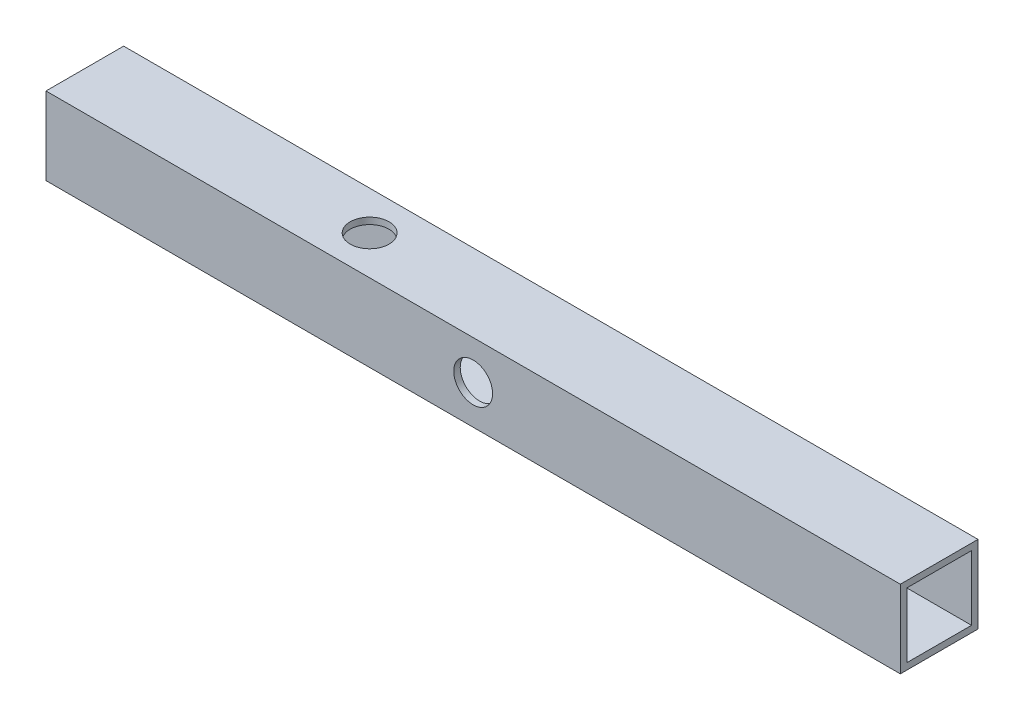
ISO-10303-21;
HEADER;
FILE_DESCRIPTION(('STEP AP214'),'2;1');
FILE_NAME('part.step','',(''),(''),'','','');
FILE_SCHEMA(('AUTOMOTIVE_DESIGN { 1 0 10303 214 1 1 1 1 }'));
ENDSEC;
DATA;
#1=APPLICATION_CONTEXT('core data for automotive mechanical design processes');
#2=APPLICATION_PROTOCOL_DEFINITION('international standard','automotive_design',2000,#1);
#3=PRODUCT_CONTEXT('',#1,'mechanical');
#4=PRODUCT('Part','Part','',(#3));
#5=PRODUCT_RELATED_PRODUCT_CATEGORY('part','',(#4));
#6=PRODUCT_DEFINITION_FORMATION('','',#4);
#7=PRODUCT_DEFINITION_CONTEXT('part definition',#1,'design');
#8=PRODUCT_DEFINITION('design','',#6,#7);
#9=PRODUCT_DEFINITION_SHAPE('','',#8);
#10=(LENGTH_UNIT() NAMED_UNIT(*) SI_UNIT(.MILLI.,.METRE.));
#11=(NAMED_UNIT(*) PLANE_ANGLE_UNIT() SI_UNIT($,.RADIAN.));
#12=(NAMED_UNIT(*) SI_UNIT($,.STERADIAN.) SOLID_ANGLE_UNIT());
#13=UNCERTAINTY_MEASURE_WITH_UNIT(LENGTH_MEASURE(1.E-05),#10,'distance_accuracy_value','');
#14=(GEOMETRIC_REPRESENTATION_CONTEXT(3) GLOBAL_UNCERTAINTY_ASSIGNED_CONTEXT((#13)) GLOBAL_UNIT_ASSIGNED_CONTEXT((#10,
#11,#12)) REPRESENTATION_CONTEXT('',''));
#15=CARTESIAN_POINT('',(0.,0.,0.));
#16=DIRECTION('',(0.,0.,1.));
#17=DIRECTION('',(1.,0.,0.));
#18=AXIS2_PLACEMENT_3D('',#15,#16,#17);
#19=CARTESIAN_POINT('',(104.775,0.,0.));
#20=DIRECTION('',(1.,0.,0.));
#21=DIRECTION('',(0.,0.,-1.));
#22=AXIS2_PLACEMENT_3D('',#19,#20,#21);
#23=PLANE('',#22);
#24=DIRECTION('',(0.,0.,-1.));
#25=VECTOR('',#24,1.);
#26=CARTESIAN_POINT('',(104.775,-9.525,-9.525));
#27=LINE('',#26,#25);
#28=CARTESIAN_POINT('',(104.775,-9.525,9.525));
#29=VERTEX_POINT('',#28);
#30=CARTESIAN_POINT('',(104.775,-9.525,-9.525));
#31=VERTEX_POINT('',#30);
#32=EDGE_CURVE('E139',#29,#31,#27,.T.);
#33=ORIENTED_EDGE('',*,*,#32,.T.);
#34=DIRECTION('',(0.,1.,0.));
#35=VECTOR('',#34,1.);
#36=CARTESIAN_POINT('',(104.775,9.525,-9.525));
#37=LINE('',#36,#35);
#38=CARTESIAN_POINT('',(104.775,9.525,-9.525));
#39=VERTEX_POINT('',#38);
#40=EDGE_CURVE('E142',#31,#39,#37,.T.);
#41=ORIENTED_EDGE('',*,*,#40,.T.);
#42=DIRECTION('',(0.,0.,1.));
#43=VECTOR('',#42,1.);
#44=CARTESIAN_POINT('',(104.775,9.525,-9.525));
#45=LINE('',#44,#43);
#46=CARTESIAN_POINT('',(104.775,9.525,9.525));
#47=VERTEX_POINT('',#46);
#48=EDGE_CURVE('E145',#39,#47,#45,.T.);
#49=ORIENTED_EDGE('',*,*,#48,.T.);
#50=DIRECTION('',(0.,-1.,0.));
#51=VECTOR('',#50,1.);
#52=CARTESIAN_POINT('',(104.775,9.525,9.525));
#53=LINE('',#52,#51);
#54=EDGE_CURVE('E147',#47,#29,#53,.T.);
#55=ORIENTED_EDGE('',*,*,#54,.T.);
#56=EDGE_LOOP('',(#33,#41,#49,#55));
#57=FACE_BOUND('',#56,.T.);
#58=DIRECTION('',(0.,1.,0.));
#59=VECTOR('',#58,1.);
#60=CARTESIAN_POINT('',(104.775,7.9375,-7.9375));
#61=LINE('',#60,#59);
#62=CARTESIAN_POINT('',(104.775,-7.9375,-7.9375));
#63=VERTEX_POINT('',#62);
#64=CARTESIAN_POINT('',(104.775,7.9375,-7.9375));
#65=VERTEX_POINT('',#64);
#66=EDGE_CURVE('E109',#63,#65,#61,.T.);
#67=ORIENTED_EDGE('',*,*,#66,.F.);
#68=DIRECTION('',(0.,0.,-1.));
#69=VECTOR('',#68,1.);
#70=CARTESIAN_POINT('',(104.775,-7.9375,-7.9375));
#71=LINE('',#70,#69);
#72=CARTESIAN_POINT('',(104.775,-7.9375,7.9375));
#73=VERTEX_POINT('',#72);
#74=EDGE_CURVE('E101',#73,#63,#71,.T.);
#75=ORIENTED_EDGE('',*,*,#74,.F.);
#76=DIRECTION('',(0.,-1.,0.));
#77=VECTOR('',#76,1.);
#78=CARTESIAN_POINT('',(104.775,7.9375,7.9375));
#79=LINE('',#78,#77);
#80=CARTESIAN_POINT('',(104.775,7.9375,7.9375));
#81=VERTEX_POINT('',#80);
#82=EDGE_CURVE('E123',#81,#73,#79,.T.);
#83=ORIENTED_EDGE('',*,*,#82,.F.);
#84=DIRECTION('',(0.,0.,1.));
#85=VECTOR('',#84,1.);
#86=CARTESIAN_POINT('',(104.775,7.9375,-7.9375));
#87=LINE('',#86,#85);
#88=EDGE_CURVE('E121',#65,#81,#87,.T.);
#89=ORIENTED_EDGE('',*,*,#88,.F.);
#90=EDGE_LOOP('',(#67,#75,#83,#89));
#91=FACE_BOUND('',#90,.T.);
#92=ADVANCED_FACE('F35',(#57,#91),#23,.T.);
#93=CARTESIAN_POINT('',(-104.775,0.,0.));
#94=DIRECTION('',(1.,0.,0.));
#95=DIRECTION('',(0.,0.,-1.));
#96=AXIS2_PLACEMENT_3D('',#93,#94,#95);
#97=PLANE('',#96);
#98=DIRECTION('',(0.,0.,-1.));
#99=VECTOR('',#98,1.);
#100=CARTESIAN_POINT('',(-104.775,-9.525,-9.525));
#101=LINE('',#100,#99);
#102=CARTESIAN_POINT('',(-104.775,-9.525,9.525));
#103=VERTEX_POINT('',#102);
#104=CARTESIAN_POINT('',(-104.775,-9.525,-9.525));
#105=VERTEX_POINT('',#104);
#106=EDGE_CURVE('E117',#103,#105,#101,.T.);
#107=ORIENTED_EDGE('',*,*,#106,.F.);
#108=DIRECTION('',(0.,-1.,0.));
#109=VECTOR('',#108,1.);
#110=CARTESIAN_POINT('',(-104.775,9.525,9.525));
#111=LINE('',#110,#109);
#112=CARTESIAN_POINT('',(-104.775,9.525,9.525));
#113=VERTEX_POINT('',#112);
#114=EDGE_CURVE('E143',#113,#103,#111,.T.);
#115=ORIENTED_EDGE('',*,*,#114,.F.);
#116=DIRECTION('',(0.,0.,1.));
#117=VECTOR('',#116,1.);
#118=CARTESIAN_POINT('',(-104.775,9.525,-9.525));
#119=LINE('',#118,#117);
#120=CARTESIAN_POINT('',(-104.775,9.525,-9.525));
#121=VERTEX_POINT('',#120);
#122=EDGE_CURVE('E154',#121,#113,#119,.T.);
#123=ORIENTED_EDGE('',*,*,#122,.F.);
#124=DIRECTION('',(0.,1.,0.));
#125=VECTOR('',#124,1.);
#126=CARTESIAN_POINT('',(-104.775,9.525,-9.525));
#127=LINE('',#126,#125);
#128=EDGE_CURVE('E152',#105,#121,#127,.T.);
#129=ORIENTED_EDGE('',*,*,#128,.F.);
#130=EDGE_LOOP('',(#107,#115,#123,#129));
#131=FACE_BOUND('',#130,.T.);
#132=DIRECTION('',(0.,0.,-1.));
#133=VECTOR('',#132,1.);
#134=CARTESIAN_POINT('',(-104.775,-7.9375,-7.9375));
#135=LINE('',#134,#133);
#136=CARTESIAN_POINT('',(-104.775,-7.9375,7.9375));
#137=VERTEX_POINT('',#136);
#138=CARTESIAN_POINT('',(-104.775,-7.9375,-7.9375));
#139=VERTEX_POINT('',#138);
#140=EDGE_CURVE('E59',#137,#139,#135,.T.);
#141=ORIENTED_EDGE('',*,*,#140,.T.);
#142=DIRECTION('',(0.,1.,0.));
#143=VECTOR('',#142,1.);
#144=CARTESIAN_POINT('',(-104.775,7.9375,-7.9375));
#145=LINE('',#144,#143);
#146=CARTESIAN_POINT('',(-104.775,7.9375,-7.9375));
#147=VERTEX_POINT('',#146);
#148=EDGE_CURVE('E116',#139,#147,#145,.T.);
#149=ORIENTED_EDGE('',*,*,#148,.T.);
#150=DIRECTION('',(0.,0.,1.));
#151=VECTOR('',#150,1.);
#152=CARTESIAN_POINT('',(-104.775,7.9375,-7.9375));
#153=LINE('',#152,#151);
#154=CARTESIAN_POINT('',(-104.775,7.9375,7.9375));
#155=VERTEX_POINT('',#154);
#156=EDGE_CURVE('E131',#147,#155,#153,.T.);
#157=ORIENTED_EDGE('',*,*,#156,.T.);
#158=DIRECTION('',(0.,-1.,0.));
#159=VECTOR('',#158,1.);
#160=CARTESIAN_POINT('',(-104.775,7.9375,7.9375));
#161=LINE('',#160,#159);
#162=EDGE_CURVE('E110',#155,#137,#161,.T.);
#163=ORIENTED_EDGE('',*,*,#162,.T.);
#164=EDGE_LOOP('',(#141,#149,#157,#163));
#165=FACE_BOUND('',#164,.T.);
#166=ADVANCED_FACE('F173',(#131,#165),#97,.F.);
#167=CARTESIAN_POINT('',(104.775,-9.525,-9.525));
#168=DIRECTION('',(0.,1.,0.));
#169=DIRECTION('',(0.,0.,1.));
#170=AXIS2_PLACEMENT_3D('',#167,#168,#169);
#171=PLANE('',#170);
#172=CARTESIAN_POINT('',(-34.925,-9.525,0.));
#173=DIRECTION('',(0.,-1.,0.));
#174=DIRECTION('',(0.,0.,-1.));
#175=AXIS2_PLACEMENT_3D('',#172,#173,#174);
#176=CIRCLE('',#175,4.7625);
#177=CARTESIAN_POINT('',(-34.925,-9.525,-4.76250000000001));
#178=VERTEX_POINT('',#177);
#179=EDGE_CURVE('E273',#178,#178,#176,.T.);
#180=ORIENTED_EDGE('',*,*,#179,.F.);
#181=EDGE_LOOP('',(#180));
#182=FACE_BOUND('',#181,.T.);
#183=ORIENTED_EDGE('',*,*,#106,.T.);
#184=DIRECTION('',(-1.,0.,0.));
#185=VECTOR('',#184,1.);
#186=CARTESIAN_POINT('',(104.775,-9.525,-9.525));
#187=LINE('',#186,#185);
#188=EDGE_CURVE('E11',#31,#105,#187,.T.);
#189=ORIENTED_EDGE('',*,*,#188,.F.);
#190=ORIENTED_EDGE('',*,*,#32,.F.);
#191=DIRECTION('',(-1.,0.,0.));
#192=VECTOR('',#191,1.);
#193=CARTESIAN_POINT('',(104.775,-9.525,9.525));
#194=LINE('',#193,#192);
#195=EDGE_CURVE('E149',#29,#103,#194,.T.);
#196=ORIENTED_EDGE('',*,*,#195,.T.);
#197=EDGE_LOOP('',(#183,#189,#190,#196));
#198=FACE_BOUND('',#197,.T.);
#199=ADVANCED_FACE('F37',(#182,#198),#171,.F.);
#200=CARTESIAN_POINT('',(104.775,9.525,-9.525));
#201=DIRECTION('',(0.,0.,1.));
#202=DIRECTION('',(1.,0.,0.));
#203=AXIS2_PLACEMENT_3D('',#200,#201,#202);
#204=PLANE('',#203);
#205=CARTESIAN_POINT('',(69.85,0.,-9.525));
#206=DIRECTION('',(0.,0.,1.));
#207=DIRECTION('',(1.,0.,0.));
#208=AXIS2_PLACEMENT_3D('',#205,#206,#207);
#209=CIRCLE('',#208,4.7625);
#210=CARTESIAN_POINT('',(74.6125,0.,-9.525));
#211=VERTEX_POINT('',#210);
#212=EDGE_CURVE('E214',#211,#211,#209,.T.);
#213=ORIENTED_EDGE('',*,*,#212,.T.);
#214=EDGE_LOOP('',(#213));
#215=FACE_BOUND('',#214,.T.);
#216=CARTESIAN_POINT('',(-69.85,0.,-9.525));
#217=DIRECTION('',(0.,0.,1.));
#218=DIRECTION('',(1.,0.,0.));
#219=AXIS2_PLACEMENT_3D('',#216,#217,#218);
#220=CIRCLE('',#219,4.7625);
#221=CARTESIAN_POINT('',(-65.0875,0.,-9.525));
#222=VERTEX_POINT('',#221);
#223=EDGE_CURVE('E227',#222,#222,#220,.T.);
#224=ORIENTED_EDGE('',*,*,#223,.T.);
#225=EDGE_LOOP('',(#224));
#226=FACE_BOUND('',#225,.T.);
#227=ORIENTED_EDGE('',*,*,#128,.T.);
#228=DIRECTION('',(-1.,0.,0.));
#229=VECTOR('',#228,1.);
#230=CARTESIAN_POINT('',(104.775,9.525,-9.525));
#231=LINE('',#230,#229);
#232=EDGE_CURVE('E44',#39,#121,#231,.T.);
#233=ORIENTED_EDGE('',*,*,#232,.F.);
#234=ORIENTED_EDGE('',*,*,#40,.F.);
#235=ORIENTED_EDGE('',*,*,#188,.T.);
#236=EDGE_LOOP('',(#227,#233,#234,#235));
#237=FACE_BOUND('',#236,.T.);
#238=ADVANCED_FACE('F183',(#215,#226,#237),#204,.F.);
#239=CARTESIAN_POINT('',(104.775,9.525,-9.525));
#240=DIRECTION('',(0.,-1.,0.));
#241=DIRECTION('',(0.,0.,-1.));
#242=AXIS2_PLACEMENT_3D('',#239,#240,#241);
#243=PLANE('',#242);
#244=CARTESIAN_POINT('',(-34.925,9.525,0.));
#245=DIRECTION('',(0.,-1.,0.));
#246=DIRECTION('',(0.,0.,-1.));
#247=AXIS2_PLACEMENT_3D('',#244,#245,#246);
#248=CIRCLE('',#247,4.7625);
#249=CARTESIAN_POINT('',(-34.925,9.525,-4.7625));
#250=VERTEX_POINT('',#249);
#251=EDGE_CURVE('E272',#250,#250,#248,.T.);
#252=ORIENTED_EDGE('',*,*,#251,.T.);
#253=EDGE_LOOP('',(#252));
#254=FACE_BOUND('',#253,.T.);
#255=ORIENTED_EDGE('',*,*,#122,.T.);
#256=DIRECTION('',(-1.,0.,0.));
#257=VECTOR('',#256,1.);
#258=CARTESIAN_POINT('',(104.775,9.525,9.525));
#259=LINE('',#258,#257);
#260=EDGE_CURVE('E159',#47,#113,#259,.T.);
#261=ORIENTED_EDGE('',*,*,#260,.F.);
#262=ORIENTED_EDGE('',*,*,#48,.F.);
#263=ORIENTED_EDGE('',*,*,#232,.T.);
#264=EDGE_LOOP('',(#255,#261,#262,#263));
#265=FACE_BOUND('',#264,.T.);
#266=ADVANCED_FACE('F167',(#254,#265),#243,.F.);
#267=CARTESIAN_POINT('',(104.775,9.525,9.525));
#268=DIRECTION('',(0.,0.,-1.));
#269=DIRECTION('',(-1.,0.,0.));
#270=AXIS2_PLACEMENT_3D('',#267,#268,#269);
#271=PLANE('',#270);
#272=CARTESIAN_POINT('',(0.,0.,9.525));
#273=DIRECTION('',(0.,0.,1.));
#274=DIRECTION('',(1.,0.,0.));
#275=AXIS2_PLACEMENT_3D('',#272,#273,#274);
#276=CIRCLE('',#275,4.7625);
#277=CARTESIAN_POINT('',(4.7625,0.,9.525));
#278=VERTEX_POINT('',#277);
#279=EDGE_CURVE('E212',#278,#278,#276,.T.);
#280=ORIENTED_EDGE('',*,*,#279,.F.);
#281=EDGE_LOOP('',(#280));
#282=FACE_BOUND('',#281,.T.);
#283=ORIENTED_EDGE('',*,*,#114,.T.);
#284=ORIENTED_EDGE('',*,*,#195,.F.);
#285=ORIENTED_EDGE('',*,*,#54,.F.);
#286=ORIENTED_EDGE('',*,*,#260,.T.);
#287=EDGE_LOOP('',(#283,#284,#285,#286));
#288=FACE_BOUND('',#287,.T.);
#289=ADVANCED_FACE('F177',(#282,#288),#271,.F.);
#290=CARTESIAN_POINT('',(104.775,-7.9375,-7.9375));
#291=DIRECTION('',(0.,1.,0.));
#292=DIRECTION('',(0.,0.,1.));
#293=AXIS2_PLACEMENT_3D('',#290,#291,#292);
#294=PLANE('',#293);
#295=CARTESIAN_POINT('',(-34.925,-7.9375,0.));
#296=DIRECTION('',(0.,1.,0.));
#297=DIRECTION('',(0.,0.,1.));
#298=AXIS2_PLACEMENT_3D('',#295,#296,#297);
#299=CIRCLE('',#298,4.7625);
#300=CARTESIAN_POINT('',(-34.925,-7.9375,4.7625));
#301=VERTEX_POINT('',#300);
#302=EDGE_CURVE('E220',#301,#301,#299,.F.);
#303=ORIENTED_EDGE('',*,*,#302,.T.);
#304=EDGE_LOOP('',(#303));
#305=FACE_BOUND('',#304,.T.);
#306=ORIENTED_EDGE('',*,*,#140,.F.);
#307=DIRECTION('',(-1.,0.,0.));
#308=VECTOR('',#307,1.);
#309=CARTESIAN_POINT('',(104.775,-7.9375,7.9375));
#310=LINE('',#309,#308);
#311=EDGE_CURVE('E105',#73,#137,#310,.T.);
#312=ORIENTED_EDGE('',*,*,#311,.F.);
#313=ORIENTED_EDGE('',*,*,#74,.T.);
#314=DIRECTION('',(-1.,0.,0.));
#315=VECTOR('',#314,1.);
#316=CARTESIAN_POINT('',(104.775,-7.9375,-7.9375));
#317=LINE('',#316,#315);
#318=EDGE_CURVE('E104',#63,#139,#317,.T.);
#319=ORIENTED_EDGE('',*,*,#318,.T.);
#320=EDGE_LOOP('',(#306,#312,#313,#319));
#321=FACE_BOUND('',#320,.T.);
#322=ADVANCED_FACE('F103',(#305,#321),#294,.T.);
#323=CARTESIAN_POINT('',(104.775,7.9375,-7.9375));
#324=DIRECTION('',(0.,0.,1.));
#325=DIRECTION('',(1.,0.,0.));
#326=AXIS2_PLACEMENT_3D('',#323,#324,#325);
#327=PLANE('',#326);
#328=CARTESIAN_POINT('',(69.85,0.,-7.9375));
#329=DIRECTION('',(0.,0.,1.));
#330=DIRECTION('',(1.,0.,0.));
#331=AXIS2_PLACEMENT_3D('',#328,#329,#330);
#332=CIRCLE('',#331,4.7625);
#333=CARTESIAN_POINT('',(74.6125,0.,-7.9375));
#334=VERTEX_POINT('',#333);
#335=EDGE_CURVE('E217',#334,#334,#332,.T.);
#336=ORIENTED_EDGE('',*,*,#335,.F.);
#337=EDGE_LOOP('',(#336));
#338=FACE_BOUND('',#337,.T.);
#339=CARTESIAN_POINT('',(-69.85,0.,-7.9375));
#340=DIRECTION('',(0.,0.,1.));
#341=DIRECTION('',(1.,0.,0.));
#342=AXIS2_PLACEMENT_3D('',#339,#340,#341);
#343=CIRCLE('',#342,4.7625);
#344=CARTESIAN_POINT('',(-65.0875,0.,-7.9375));
#345=VERTEX_POINT('',#344);
#346=EDGE_CURVE('E129',#345,#345,#343,.T.);
#347=ORIENTED_EDGE('',*,*,#346,.F.);
#348=EDGE_LOOP('',(#347));
#349=FACE_BOUND('',#348,.T.);
#350=ORIENTED_EDGE('',*,*,#148,.F.);
#351=ORIENTED_EDGE('',*,*,#318,.F.);
#352=ORIENTED_EDGE('',*,*,#66,.T.);
#353=DIRECTION('',(-1.,0.,0.));
#354=VECTOR('',#353,1.);
#355=CARTESIAN_POINT('',(104.775,7.9375,-7.9375));
#356=LINE('',#355,#354);
#357=EDGE_CURVE('E118',#65,#147,#356,.T.);
#358=ORIENTED_EDGE('',*,*,#357,.T.);
#359=EDGE_LOOP('',(#350,#351,#352,#358));
#360=FACE_BOUND('',#359,.T.);
#361=ADVANCED_FACE('F113',(#338,#349,#360),#327,.T.);
#362=CARTESIAN_POINT('',(104.775,7.9375,-7.9375));
#363=DIRECTION('',(0.,-1.,0.));
#364=DIRECTION('',(0.,0.,-1.));
#365=AXIS2_PLACEMENT_3D('',#362,#363,#364);
#366=PLANE('',#365);
#367=CARTESIAN_POINT('',(-34.925,7.9375,0.));
#368=DIRECTION('',(0.,-1.,0.));
#369=DIRECTION('',(0.,0.,-1.));
#370=AXIS2_PLACEMENT_3D('',#367,#368,#369);
#371=CIRCLE('',#370,4.7625);
#372=CARTESIAN_POINT('',(-34.925,7.9375,-4.7625));
#373=VERTEX_POINT('',#372);
#374=EDGE_CURVE('E39',#373,#373,#371,.F.);
#375=ORIENTED_EDGE('',*,*,#374,.T.);
#376=EDGE_LOOP('',(#375));
#377=FACE_BOUND('',#376,.T.);
#378=ORIENTED_EDGE('',*,*,#156,.F.);
#379=ORIENTED_EDGE('',*,*,#357,.F.);
#380=ORIENTED_EDGE('',*,*,#88,.T.);
#381=DIRECTION('',(-1.,0.,0.));
#382=VECTOR('',#381,1.);
#383=CARTESIAN_POINT('',(104.775,7.9375,7.9375));
#384=LINE('',#383,#382);
#385=EDGE_CURVE('E51',#81,#155,#384,.T.);
#386=ORIENTED_EDGE('',*,*,#385,.T.);
#387=EDGE_LOOP('',(#378,#379,#380,#386));
#388=FACE_BOUND('',#387,.T.);
#389=ADVANCED_FACE('F236',(#377,#388),#366,.T.);
#390=CARTESIAN_POINT('',(104.775,7.9375,7.9375));
#391=DIRECTION('',(0.,0.,-1.));
#392=DIRECTION('',(-1.,0.,0.));
#393=AXIS2_PLACEMENT_3D('',#390,#391,#392);
#394=PLANE('',#393);
#395=CARTESIAN_POINT('',(0.,0.,7.9375));
#396=DIRECTION('',(0.,0.,-1.));
#397=DIRECTION('',(-1.,0.,0.));
#398=AXIS2_PLACEMENT_3D('',#395,#396,#397);
#399=CIRCLE('',#398,4.7625);
#400=CARTESIAN_POINT('',(-4.7625,0.,7.9375));
#401=VERTEX_POINT('',#400);
#402=EDGE_CURVE('E215',#401,#401,#399,.F.);
#403=ORIENTED_EDGE('',*,*,#402,.T.);
#404=EDGE_LOOP('',(#403));
#405=FACE_BOUND('',#404,.T.);
#406=ORIENTED_EDGE('',*,*,#162,.F.);
#407=ORIENTED_EDGE('',*,*,#385,.F.);
#408=ORIENTED_EDGE('',*,*,#82,.T.);
#409=ORIENTED_EDGE('',*,*,#311,.T.);
#410=EDGE_LOOP('',(#406,#407,#408,#409));
#411=FACE_BOUND('',#410,.T.);
#412=ADVANCED_FACE('F241',(#405,#411),#394,.T.);
#413=CARTESIAN_POINT('',(-69.85,0.,9.526));
#414=DIRECTION('',(0.,0.,-1.));
#415=DIRECTION('',(-1.,0.,0.));
#416=AXIS2_PLACEMENT_3D('',#413,#414,#415);
#417=CYLINDRICAL_SURFACE('',#416,4.7625);
#418=ORIENTED_EDGE('',*,*,#346,.T.);
#419=EDGE_LOOP('',(#418));
#420=FACE_BOUND('',#419,.T.);
#421=ORIENTED_EDGE('',*,*,#223,.F.);
#422=EDGE_LOOP('',(#421));
#423=FACE_BOUND('',#422,.T.);
#424=ADVANCED_FACE('F232',(#420,#423),#417,.F.);
#425=CARTESIAN_POINT('',(69.85,0.,9.526));
#426=DIRECTION('',(0.,0.,-1.));
#427=DIRECTION('',(-1.,0.,0.));
#428=AXIS2_PLACEMENT_3D('',#425,#426,#427);
#429=CYLINDRICAL_SURFACE('',#428,4.7625);
#430=ORIENTED_EDGE('',*,*,#335,.T.);
#431=EDGE_LOOP('',(#430));
#432=FACE_BOUND('',#431,.T.);
#433=ORIENTED_EDGE('',*,*,#212,.F.);
#434=EDGE_LOOP('',(#433));
#435=FACE_BOUND('',#434,.T.);
#436=ADVANCED_FACE('F251',(#432,#435),#429,.F.);
#437=CARTESIAN_POINT('',(0.,0.,-9.526));
#438=DIRECTION('',(0.,0.,1.));
#439=DIRECTION('',(1.,0.,0.));
#440=AXIS2_PLACEMENT_3D('',#437,#438,#439);
#441=CYLINDRICAL_SURFACE('',#440,4.7625);
#442=ORIENTED_EDGE('',*,*,#402,.F.);
#443=EDGE_LOOP('',(#442));
#444=FACE_BOUND('',#443,.T.);
#445=ORIENTED_EDGE('',*,*,#279,.T.);
#446=EDGE_LOOP('',(#445));
#447=FACE_BOUND('',#446,.T.);
#448=ADVANCED_FACE('F254',(#444,#447),#441,.F.);
#449=CARTESIAN_POINT('',(-34.925,-9.525,0.));
#450=DIRECTION('',(0.,1.,0.));
#451=DIRECTION('',(0.,0.,1.));
#452=AXIS2_PLACEMENT_3D('',#449,#450,#451);
#453=CYLINDRICAL_SURFACE('',#452,4.7625);
#454=ORIENTED_EDGE('',*,*,#374,.F.);
#455=EDGE_LOOP('',(#454));
#456=FACE_BOUND('',#455,.T.);
#457=ORIENTED_EDGE('',*,*,#251,.F.);
#458=EDGE_LOOP('',(#457));
#459=FACE_BOUND('',#458,.T.);
#460=ADVANCED_FACE('F258',(#456,#459),#453,.F.);
#461=ORIENTED_EDGE('',*,*,#302,.F.);
#462=EDGE_LOOP('',(#461));
#463=FACE_BOUND('',#462,.T.);
#464=ORIENTED_EDGE('',*,*,#179,.T.);
#465=EDGE_LOOP('',(#464));
#466=FACE_BOUND('',#465,.T.);
#467=ADVANCED_FACE('F261',(#463,#466),#453,.F.);
#468=CLOSED_SHELL('',(#92,#166,#199,#238,#266,#289,#322,#361,#389,#412,#424,#436,#448,#460,#467));
#469=MANIFOLD_SOLID_BREP('B2',#468);
#470=ADVANCED_BREP_SHAPE_REPRESENTATION('',(#18,#469),#14);
#471=SHAPE_DEFINITION_REPRESENTATION(#9,#470);
ENDSEC;
END-ISO-10303-21;
